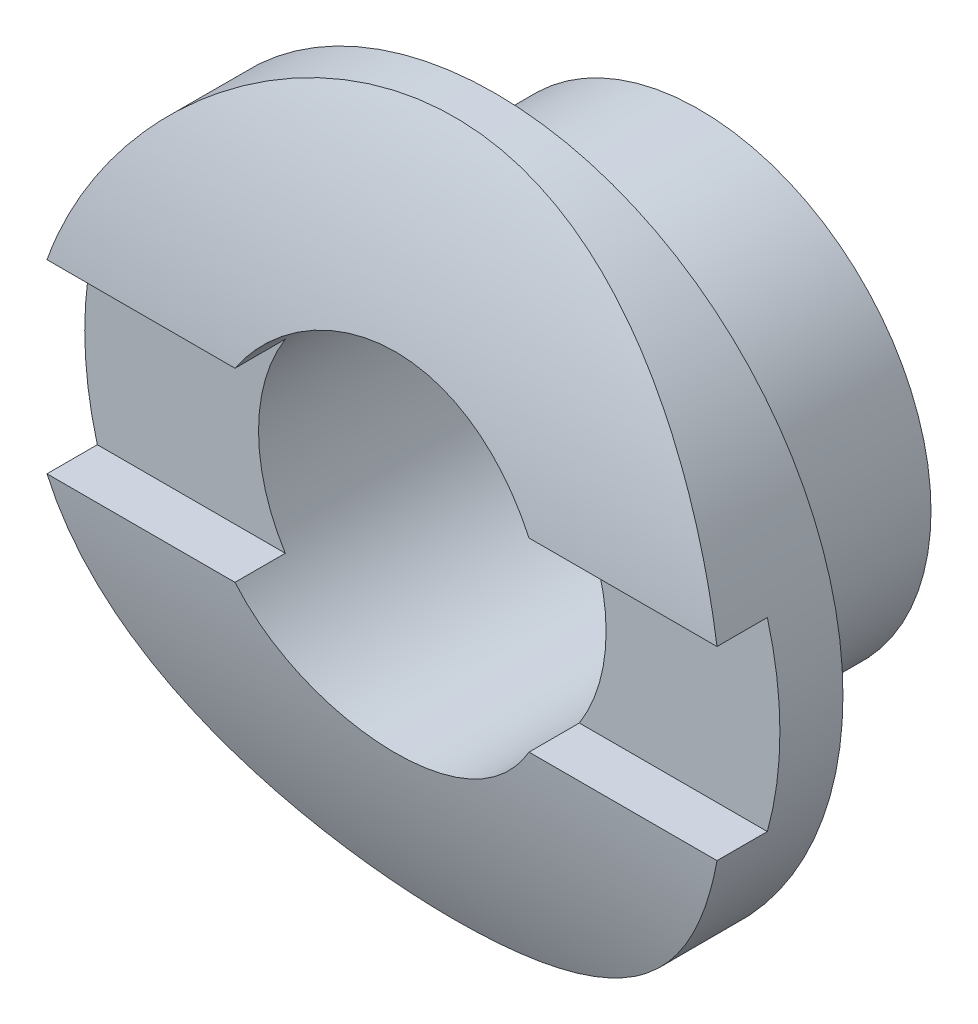
ISO-10303-21;
HEADER;
FILE_DESCRIPTION(('STEP AP214'),'2;1');
FILE_NAME('part.step','',(''),(''),'','','');
FILE_SCHEMA(('AUTOMOTIVE_DESIGN { 1 0 10303 214 1 1 1 1 }'));
ENDSEC;
DATA;
#1=APPLICATION_CONTEXT('core data for automotive mechanical design processes');
#2=APPLICATION_PROTOCOL_DEFINITION('international standard','automotive_design',2000,#1);
#3=PRODUCT_CONTEXT('',#1,'mechanical');
#4=PRODUCT('Part','Part','',(#3));
#5=PRODUCT_RELATED_PRODUCT_CATEGORY('part','',(#4));
#6=PRODUCT_DEFINITION_FORMATION('','',#4);
#7=PRODUCT_DEFINITION_CONTEXT('part definition',#1,'design');
#8=PRODUCT_DEFINITION('design','',#6,#7);
#9=PRODUCT_DEFINITION_SHAPE('','',#8);
#10=(LENGTH_UNIT() NAMED_UNIT(*) SI_UNIT(.MILLI.,.METRE.));
#11=(NAMED_UNIT(*) PLANE_ANGLE_UNIT() SI_UNIT($,.RADIAN.));
#12=(NAMED_UNIT(*) SI_UNIT($,.STERADIAN.) SOLID_ANGLE_UNIT());
#13=UNCERTAINTY_MEASURE_WITH_UNIT(LENGTH_MEASURE(1.E-05),#10,'distance_accuracy_value','');
#14=(GEOMETRIC_REPRESENTATION_CONTEXT(3) GLOBAL_UNCERTAINTY_ASSIGNED_CONTEXT((#13)) GLOBAL_UNIT_ASSIGNED_CONTEXT((#10,
#11,#12)) REPRESENTATION_CONTEXT('',''));
#15=CARTESIAN_POINT('',(0.,0.,0.));
#16=DIRECTION('',(0.,0.,1.));
#17=DIRECTION('',(1.,0.,0.));
#18=AXIS2_PLACEMENT_3D('',#15,#16,#17);
#19=CARTESIAN_POINT('',(-4.7625,0.,-6.7564));
#20=DIRECTION('',(1.,0.,0.));
#21=DIRECTION('',(0.,0.,-1.));
#22=AXIS2_PLACEMENT_3D('',#19,#20,#21);
#23=CYLINDRICAL_SURFACE('',#22,11.176);
#24=DIRECTION('',(1.,0.,0.));
#25=VECTOR('',#24,1.);
#26=CARTESIAN_POINT('',(-4.7625,1.27,4.34720644115236));
#27=LINE('',#26,#25);
#28=CARTESIAN_POINT('',(4.5900442535993,1.27,4.34720644115236));
#29=VERTEX_POINT('',#28);
#30=CARTESIAN_POINT('',(2.01431168454636,1.27,4.34720644115236));
#31=VERTEX_POINT('',#30);
#32=EDGE_CURVE('E208',#29,#31,#27,.F.);
#33=ORIENTED_EDGE('',*,*,#32,.F.);
#34=CARTESIAN_POINT('',(-4.7625,0.,4.41960000000001));
#35=CARTESIAN_POINT('',(-4.76249908627995,-0.12735444381493,4.41959925776926));
#36=CARTESIAN_POINT('',(-4.75738474062043,-0.25474842171347,4.41741723465418));
#37=CARTESIAN_POINT('',(-4.73697593452927,-0.508625919959165,4.4087434312503));
#38=CARTESIAN_POINT('',(-4.72167524133683,-0.6351088349256,4.40224901232513));
#39=CARTESIAN_POINT('',(-4.68101377088656,-0.886424731922299,4.38510434342349));
#40=CARTESIAN_POINT('',(-4.65563295632696,-1.01125391282532,4.37444581671034));
#41=CARTESIAN_POINT('',(-4.59506447609123,-1.25815614709239,4.34924855599192));
#42=CARTESIAN_POINT('',(-4.5598728019437,-1.38022805181781,4.33470823608635));
#43=CARTESIAN_POINT('',(-4.48017866213979,-1.62028770637933,4.30218272018447));
#44=CARTESIAN_POINT('',(-4.43571296311708,-1.73828950132155,4.2842111503986));
#45=CARTESIAN_POINT('',(-4.33778408831479,-1.96999507589533,4.24523305288586));
#46=CARTESIAN_POINT('',(-4.28431754624326,-2.08369722791548,4.2242253900856));
#47=CARTESIAN_POINT('',(-4.11111011606995,-2.41718739634414,4.15741677155239));
#48=CARTESIAN_POINT('',(-3.978455841027,-2.62967447714953,4.10778545222371));
#49=CARTESIAN_POINT('',(-3.67545614342657,-3.0398413194107,4.00043683776008));
#50=CARTESIAN_POINT('',(-3.50361839437496,-3.23633649746127,3.94244726509601));
#51=CARTESIAN_POINT('',(-3.13007708260298,-3.59884522799375,3.82601667255385));
#52=CARTESIAN_POINT('',(-2.92835722668354,-3.76484203994382,3.76757542298037));
#53=CARTESIAN_POINT('',(-2.6012709950442,-3.99170317278959,3.68277087068401));
#54=CARTESIAN_POINT('',(-2.48496431647269,-4.06513675985705,3.65431868745183));
#55=CARTESIAN_POINT('',(-2.24601182014853,-4.20187538576694,3.59988432677018));
#56=CARTESIAN_POINT('',(-2.12336866240447,-4.26518462975583,3.57390112565816));
#57=CARTESIAN_POINT('',(-1.87249680865822,-4.38112580523432,3.5252667542529));
#58=CARTESIAN_POINT('',(-1.74426794391121,-4.43375741387929,3.50261568471432));
#59=CARTESIAN_POINT('',(-1.48317221169835,-4.52778570400235,3.46146515562879));
#60=CARTESIAN_POINT('',(-1.35030780611148,-4.56918824959663,3.44296353000872));
#61=CARTESIAN_POINT('',(-1.08755046301325,-4.63855409165762,3.41159733354156));
#62=CARTESIAN_POINT('',(-0.957833581954807,-4.66707896726807,3.39849996545762));
#63=CARTESIAN_POINT('',(-0.696134849602933,-4.71322025152352,3.3771669695108));
#64=CARTESIAN_POINT('',(-0.564154089332185,-4.73084177096361,3.36892906392771));
#65=CARTESIAN_POINT('',(-0.298996781359505,-4.75496845145458,3.35762143018875));
#66=CARTESIAN_POINT('',(-0.165820587893187,-4.76147680296426,3.35455021873996));
#67=CARTESIAN_POINT('',(0.100621649801287,-4.76330004999866,3.35369154242626));
#68=CARTESIAN_POINT('',(0.233887688542796,-4.75861557632652,3.35590377979772));
#69=CARTESIAN_POINT('',(0.488580372698107,-4.73895153644503,3.3651323548155));
#70=CARTESIAN_POINT('',(0.61008982699337,-4.72483866990486,3.37174408268427));
#71=CARTESIAN_POINT('',(0.851409952819883,-4.6873684780483,3.3891398600058));
#72=CARTESIAN_POINT('',(0.971220057888757,-4.66400814185932,3.39992526833647));
#73=CARTESIAN_POINT('',(1.20828558434308,-4.6082828457106,3.425330780419));
#74=CARTESIAN_POINT('',(1.3255415609045,-4.57591986409522,3.43995004163576));
#75=CARTESIAN_POINT('',(1.55682701258214,-4.5024927957938,3.47258539193384));
#76=CARTESIAN_POINT('',(1.67085522190472,-4.46142534773528,3.49060279296559));
#77=CARTESIAN_POINT('',(2.01188019116621,-4.32372407283593,3.5498386973099));
#78=CARTESIAN_POINT('',(2.23285940515533,-4.21376111274915,3.59567895755876));
#79=CARTESIAN_POINT('',(2.65399846707199,-3.96207188696153,3.694589535023));
#80=CARTESIAN_POINT('',(2.85414985234123,-3.82033278335094,3.74766277103209));
#81=CARTESIAN_POINT('',(3.24679379086405,-3.4943496617202,3.86079518680427));
#82=CARTESIAN_POINT('',(3.43702867085161,-3.30744916848156,3.92105625279314));
#83=CARTESIAN_POINT('',(3.7842879810317,-2.90368686043525,4.03783890985767));
#84=CARTESIAN_POINT('',(3.94130390695026,-2.68681739680588,4.09435954081819));
#85=CARTESIAN_POINT('',(4.15019671273543,-2.34012085443301,4.17252605283561));
#86=CARTESIAN_POINT('',(4.21604578105556,-2.21931601956612,4.19775470369621));
#87=CARTESIAN_POINT('',(4.33724729538594,-1.97196094223773,4.24497082997028));
#88=CARTESIAN_POINT('',(4.39260402270449,-1.84541306941143,4.26695962655908));
#89=CARTESIAN_POINT('',(4.49226298925976,-1.58748121713849,4.30704957816776));
#90=CARTESIAN_POINT('',(4.53656798520304,-1.45609845309236,4.32515170250882));
#91=CARTESIAN_POINT('',(4.61365506739347,-1.18947201257857,4.35693196271366));
#92=CARTESIAN_POINT('',(4.64643807481995,-1.05422864570007,4.37061045223864));
#93=CARTESIAN_POINT('',(4.69832848861546,-0.789963788052934,4.39238220052065));
#94=CARTESIAN_POINT('',(4.71819145272836,-0.661115547956151,4.40078279099879));
#95=CARTESIAN_POINT('',(4.74729206355814,-0.402015113450935,4.41311999282715));
#96=CARTESIAN_POINT('',(4.756530326094,-0.271763000854194,4.41705686289915));
#97=CARTESIAN_POINT('',(4.76427414782392,-0.0109155631938609,4.42035559316027));
#98=CARTESIAN_POINT('',(4.76278244338882,0.11967966587586,4.41971861977726));
#99=CARTESIAN_POINT('',(4.74909140694899,0.380201175120254,4.41389100559022));
#100=CARTESIAN_POINT('',(4.73689233353275,0.510127471373777,4.40870047475696));
#101=CARTESIAN_POINT('',(4.70284598273652,0.761490842497033,4.3942997097558));
#102=CARTESIAN_POINT('',(4.68154097543584,0.883014489949856,4.38531570006133));
#103=CARTESIAN_POINT('',(4.62966534598144,1.12373956949306,4.36361923160614));
#104=CARTESIAN_POINT('',(4.59909171509113,1.2429402341152,4.35090556218438));
#105=CARTESIAN_POINT('',(4.4938743520626,1.59581161798998,4.30760925440499));
#106=CARTESIAN_POINT('',(4.40570359191107,1.82497381919436,4.27185778904461));
#107=CARTESIAN_POINT('',(4.19302209743858,2.27229436765659,4.18860678308459));
#108=CARTESIAN_POINT('',(4.06746318554019,2.48988615545105,4.14077544292814));
#109=CARTESIAN_POINT('',(3.78467479986146,2.90173271633515,4.03841270854708));
#110=CARTESIAN_POINT('',(3.62743186133187,3.09597751144233,3.9838784696498));
#111=CARTESIAN_POINT('',(3.27209552767861,3.47079479715498,3.86893896733243));
#112=CARTESIAN_POINT('',(3.07183014584953,3.6492672506089,3.80839916839721));
#113=CARTESIAN_POINT('',(2.64313619331202,3.97075799111835,3.69182344619456));
#114=CARTESIAN_POINT('',(2.4147001218667,4.11376680496345,3.63578872904083));
#115=CARTESIAN_POINT('',(2.05307932199713,4.29943407140319,3.559724222433));
#116=CARTESIAN_POINT('',(1.92817140756517,4.35689603082942,3.53552103351426));
#117=CARTESIAN_POINT('',(1.67329741644856,4.46098621692028,3.49083320092745));
#118=CARTESIAN_POINT('',(1.54333361179793,4.50761924574304,3.47034690986219));
#119=CARTESIAN_POINT('',(1.27933800840301,4.58953140281474,3.43384978588491));
#120=CARTESIAN_POINT('',(1.14530827998563,4.62481620669551,3.41783671629159));
#121=CARTESIAN_POINT('',(0.874192522749246,4.68363379904573,3.3908952755164));
#122=CARTESIAN_POINT('',(0.73710680183741,4.70716776593264,3.37996639448079));
#123=CARTESIAN_POINT('',(0.472121201921622,4.74076934422994,3.36429141877333));
#124=CARTESIAN_POINT('',(0.344363117401417,4.75176312369259,3.35912088508703));
#125=CARTESIAN_POINT('',(0.0882247786741189,4.76340858849557,3.35364242710178));
#126=CARTESIAN_POINT('',(-0.0401556690974063,4.7640568181199,3.35333612759936));
#127=CARTESIAN_POINT('',(-0.296397296226178,4.75499550369817,3.35760108626436));
#128=CARTESIAN_POINT('',(-0.42425871914086,4.74529156867568,3.36216970309846));
#129=CARTESIAN_POINT('',(-0.678576890301018,4.71564805813418,3.37601855390653));
#130=CARTESIAN_POINT('',(-0.805033090832775,4.69570462530406,3.38530056344356));
#131=CARTESIAN_POINT('',(-1.04910488728332,4.64709156941073,3.40766377767885));
#132=CARTESIAN_POINT('',(-1.16684078064725,4.61892320737778,3.42052516115437));
#133=CARTESIAN_POINT('',(-1.39943580997867,4.55385442390978,3.44980645604327));
#134=CARTESIAN_POINT('',(-1.51429394221124,4.51695100139644,3.46622759030589));
#135=CARTESIAN_POINT('',(-1.85348860185406,4.39360653848005,3.52014161391342));
#136=CARTESIAN_POINT('',(-2.07261566173582,4.29449696249918,3.56230178195823));
#137=CARTESIAN_POINT('',(-2.50503855727718,4.05840271462377,3.65750582273753));
#138=CARTESIAN_POINT('',(-2.71714347505829,3.91946083918446,3.71106019115908));
#139=CARTESIAN_POINT('',(-3.11619945155893,3.61032902117768,3.82166590531342));
#140=CARTESIAN_POINT('',(-3.30314111397788,3.44012746160521,3.87871854583733));
#141=CARTESIAN_POINT('',(-3.66156832375093,3.05747296893765,3.99523642043131));
#142=CARTESIAN_POINT('',(-3.83072694194117,2.8427655956086,4.0545450512136));
#143=CARTESIAN_POINT('',(-4.0556281793658,2.5004054377026,4.13693949587218));
#144=CARTESIAN_POINT('',(-4.12583487124168,2.38279736704716,4.16332850591355));
#145=CARTESIAN_POINT('',(-4.25606826176605,2.14150643544623,4.21319718351463));
#146=CARTESIAN_POINT('',(-4.31609966614696,2.01782641689212,4.23667819456653));
#147=CARTESIAN_POINT('',(-4.42463338511045,1.76704008849995,4.27974541260598));
#148=CARTESIAN_POINT('',(-4.4732901452037,1.64000938862141,4.29938312299597));
#149=CARTESIAN_POINT('',(-4.55966773764825,1.38179419483384,4.33461364572514));
#150=CARTESIAN_POINT('',(-4.59739378441839,1.2506117147415,4.35020838635937));
#151=CARTESIAN_POINT('',(-4.66143603525206,0.985388165214541,4.37687040435202));
#152=CARTESIAN_POINT('',(-4.68778012360295,0.851354935629632,4.38794874249384));
#153=CARTESIAN_POINT('',(-4.72886354945078,0.581281431530982,4.40529207766297));
#154=CARTESIAN_POINT('',(-4.74361125137623,0.445242675883857,4.41156054395316));
#155=CARTESIAN_POINT('',(-4.75581736234175,0.257417181408033,4.41675368644699));
#156=CARTESIAN_POINT('',(-4.7583225827945,0.205973840025434,4.41782039536514));
#157=CARTESIAN_POINT('',(-4.76166409097545,0.103022488822023,4.41924370419406));
#158=CARTESIAN_POINT('',(-4.76250036959694,0.0515144786498762,4.41960030023005));
#159=CARTESIAN_POINT('',(-4.7625,0.,4.41960000000001));
#160=B_SPLINE_CURVE_WITH_KNOTS('',3,(#34,#35,#36,#37,#38,#39,#40,#41,#42,#43,#44,#45,#46,#47,
#48,#49,#50,#51,#52,#53,#54,#55,#56,#57,#58,#59,#60,#61,#62,#63,#64,#65,#66,#67,#68,#69,#70,#71,
#72,#73,#74,#75,#76,#77,#78,#79,#80,#81,#82,#83,#84,#85,#86,#87,#88,#89,#90,#91,#92,#93,#94,#95,
#96,#97,#98,#99,#100,#101,#102,#103,#104,#105,#106,#107,#108,#109,#110,#111,#112,#113,#114,#115,
#116,#117,#118,#119,#120,#121,#122,#123,#124,#125,#126,#127,#128,#129,#130,#131,#132,#133,#134,
#135,#136,#137,#138,#139,#140,#141,#142,#143,#144,#145,#146,#147,#148,#149,#150,#151,#152,#153,
#154,#155,#156,#157,#158,#159),.UNSPECIFIED.,.T.,.F.,(4,2,2,2,2,2,2,2,2,2,2,2,2,2,2,2,2,2,2,2,2,
2,2,2,2,2,2,2,2,2,2,2,2,2,2,2,2,2,2,2,2,2,2,2,2,2,2,2,2,2,2,2,2,2,2,2,2,2,2,2,2,2,4),(0.,
0.38201115030685,0.764256258381069,1.14726502850129,1.53043051633111,1.91210488552968,
2.29392231837324,3.0565622679194,3.85546708762347,4.65480912400562,5.07575317001723,
5.49652192022872,5.91730339073732,6.33786469296505,6.73770793323449,7.13736361033699,
7.53690453172872,7.93642293639919,8.30350581798584,8.67070831607999,9.03783018455179,
9.40509408229305,10.1548201434256,10.9048496497011,11.7214694020958,12.5382979622959,
12.9574812125084,13.3764930486806,13.7954002632073,14.2142739786124,14.6056912275771,
14.9970857884388,15.388380538864,15.7796658395786,16.1503329326895,16.521120479068,
17.2620299500166,18.0260605855581,18.7904165983199,19.6117770792513,20.4333567299989,
20.8517087042049,21.2698748017648,21.6878314338868,22.1057461433475,22.4902502037987,
22.8748826971561,23.2593068942222,23.6438760137178,24.0086766710141,24.3736028441549,
25.1029377154581,25.8772045843457,26.6517597776241,27.4864520930924,27.9044846926086,
28.322323435313,28.7341079849132,29.1456957709776,29.556269423772,29.9665466590315,
30.1210681447155,30.2755904735562),.UNSPECIFIED.);
#161=CARTESIAN_POINT('',(-4.59004425359931,1.27,4.34720644115236));
#162=VERTEX_POINT('',#161);
#163=EDGE_CURVE('E178',#29,#162,#160,.T.);
#164=ORIENTED_EDGE('',*,*,#163,.T.);
#165=CARTESIAN_POINT('',(-2.01431168454636,1.27,4.34720644115236));
#166=VERTEX_POINT('',#165);
#167=EDGE_CURVE('E213',#166,#162,#27,.F.);
#168=ORIENTED_EDGE('',*,*,#167,.F.);
#169=CARTESIAN_POINT('',(-2.38125,0.,4.4196));
#170=CARTESIAN_POINT('',(-2.3812453723746,-0.132155003614596,4.41959755457693));
#171=CARTESIAN_POINT('',(-2.37021130671353,-0.264366709747853,4.4172320272524));
#172=CARTESIAN_POINT('',(-2.32640904320225,-0.525040390528454,4.40802385251336));
#173=CARTESIAN_POINT('',(-2.29362477474237,-0.653499519175429,4.4011778946861));
#174=CARTESIAN_POINT('',(-2.20739103142042,-0.902862580587149,4.38377179034517));
#175=CARTESIAN_POINT('',(-2.15396258907947,-1.02377405782377,4.37321542502283));
#176=CARTESIAN_POINT('',(-2.02802258795482,-1.25491113954769,4.34953039176637));
#177=CARTESIAN_POINT('',(-1.9555117209275,-1.36513713119603,4.33640181708173));
#178=CARTESIAN_POINT('',(-1.79229273592851,-1.57346308128293,4.30878850816872));
#179=CARTESIAN_POINT('',(-1.70134917401566,-1.67137645720433,4.29428767395423));
#180=CARTESIAN_POINT('',(-1.50435202354789,-1.8506806238609,4.26567875731085));
#181=CARTESIAN_POINT('',(-1.39829714298653,-1.93207000036216,4.25157070858823));
#182=CARTESIAN_POINT('',(-1.17271993480626,-2.07683001023698,4.22518648772817));
#183=CARTESIAN_POINT('',(-1.05306859101236,-2.14000370023633,4.21293097340781));
#184=CARTESIAN_POINT('',(-0.80454432635009,-2.2452762794749,4.19186979682291));
#185=CARTESIAN_POINT('',(-0.675672449712345,-2.28737755087331,4.18306374463387));
#186=CARTESIAN_POINT('',(-0.414384260956349,-2.34869693424378,4.17006219720279));
#187=CARTESIAN_POINT('',(-0.282048629760719,-2.36824448094583,4.16580039744375));
#188=CARTESIAN_POINT('',(-0.0159128520017445,-2.3849255356171,4.1621706251422));
#189=CARTESIAN_POINT('',(0.117887122229516,-2.38206165335694,4.16280208278859));
#190=CARTESIAN_POINT('',(0.3807165993286,-2.35426664044835,4.16882738338017));
#191=CARTESIAN_POINT('',(0.50978857615791,-2.32971662405395,4.17413897317483));
#192=CARTESIAN_POINT('',(0.76193881434847,-2.25984933522199,4.18879617645507));
#193=CARTESIAN_POINT('',(0.885016754509139,-2.214530951228,4.19814200585809));
#194=CARTESIAN_POINT('',(1.1227649458423,-2.10405908555721,4.21989664716894));
#195=CARTESIAN_POINT('',(1.23736428938765,-2.03875766063977,4.23232816956602));
#196=CARTESIAN_POINT('',(1.45412021544137,-1.89027751500839,4.25883934978073));
#197=CARTESIAN_POINT('',(1.55627518144605,-1.807096475634,4.27291922125127));
#198=CARTESIAN_POINT('',(1.74743830282305,-1.62319368591866,4.30149464022565));
#199=CARTESIAN_POINT('',(1.83613422976716,-1.52214748051414,4.31599279399476));
#200=CARTESIAN_POINT('',(1.99537034882005,-1.30645268816842,4.34350805841452));
#201=CARTESIAN_POINT('',(2.06591024381047,-1.19180387866928,4.35652514482597));
#202=CARTESIAN_POINT('',(2.18690300418608,-0.951787916102792,4.37965052150224));
#203=CARTESIAN_POINT('',(2.23731658377185,-0.826400374967643,4.3897531122294));
#204=CARTESIAN_POINT('',(2.31627337177244,-0.568671224766092,4.40586859886758));
#205=CARTESIAN_POINT('',(2.3448195946149,-0.436330576878099,4.41188205845483));
#206=CARTESIAN_POINT('',(2.37878098124961,-0.171131591746981,4.41906203484544));
#207=CARTESIAN_POINT('',(2.38462289125187,-0.0383302537227902,4.42031796181916));
#208=CARTESIAN_POINT('',(2.37416419600676,0.226350753686958,4.41809122900304));
#209=CARTESIAN_POINT('',(2.35786501205365,0.358230481686839,4.41460887337582));
#210=CARTESIAN_POINT('',(2.30394090010609,0.615922319135743,4.40335313397734));
#211=CARTESIAN_POINT('',(2.26653829082144,0.741783078225829,4.39562450542661));
#212=CARTESIAN_POINT('',(2.17171462370835,0.985445139845618,4.37674066532962));
#213=CARTESIAN_POINT('',(2.11429192165795,1.10324577945821,4.36558517234877));
#214=CARTESIAN_POINT('',(1.9801583872331,1.32921924796167,4.34086370490671));
#215=CARTESIAN_POINT('',(1.90319491611518,1.4372386685293,4.32726689936756));
#216=CARTESIAN_POINT('',(1.73249895657737,1.63898244105711,4.29923678647442));
#217=CARTESIAN_POINT('',(1.63876440913478,1.73270503514341,4.2848033765559));
#218=CARTESIAN_POINT('',(1.43523347211915,1.90486949560112,4.25642025697156));
#219=CARTESIAN_POINT('',(1.32518565221608,1.98301661880368,4.24248335924207));
#220=CARTESIAN_POINT('',(1.09327613266115,2.11972013187018,4.21695947501687));
#221=CARTESIAN_POINT('',(0.9714149346471,2.17827735312106,4.2053723888044));
#222=CARTESIAN_POINT('',(0.719981828509718,2.27375407489681,4.18596694732177));
#223=CARTESIAN_POINT('',(0.59045683815275,2.31079271658833,4.17812788412608));
#224=CARTESIAN_POINT('',(0.326834193444327,2.36253408721547,4.16706654908767));
#225=CARTESIAN_POINT('',(0.192737230733609,2.37724017938931,4.16384358207406));
#226=CARTESIAN_POINT('',(-0.0732550819966534,2.38376159046743,4.16242156029031));
#227=CARTESIAN_POINT('',(-0.205138656056966,2.37604371523563,4.16412005214717));
#228=CARTESIAN_POINT('',(-0.465680304798495,2.33897570909105,4.17211873392995));
#229=CARTESIAN_POINT('',(-0.594338413529194,2.30962580663533,4.1784188752576));
#230=CARTESIAN_POINT('',(-0.844429126055678,2.23034714078661,4.19486231228564));
#231=CARTESIAN_POINT('',(-0.965883060863616,2.1804829979679,4.20499353192626));
#232=CARTESIAN_POINT('',(-1.19877164831041,2.06164809865232,4.22796295481429));
#233=CARTESIAN_POINT('',(-1.31020531776925,1.99267546995055,4.24080142328218));
#234=CARTESIAN_POINT('',(-1.52219866660454,1.83601885030138,4.26804713942361));
#235=CARTESIAN_POINT('',(-1.6225082533397,1.74800078019269,4.28247979143047));
#236=CARTESIAN_POINT('',(-1.80708711829646,1.55643288348131,4.31111345020399));
#237=CARTESIAN_POINT('',(-1.89135269256532,1.45287948020234,4.32531440278988));
#238=CARTESIAN_POINT('',(-2.04242968741017,1.23166239954829,4.35208930048453));
#239=CARTESIAN_POINT('',(-2.10901615068068,1.11384230180273,4.36464133557956));
#240=CARTESIAN_POINT('',(-2.22133619587208,0.868442957270206,4.38648574966616));
#241=CARTESIAN_POINT('',(-2.26708767636242,0.740872197378992,4.39578092491734));
#242=CARTESIAN_POINT('',(-2.32806366747813,0.510935504312515,4.40835965253543));
#243=CARTESIAN_POINT('',(-2.34797127676331,0.409834749868542,4.41254912784698));
#244=CARTESIAN_POINT('',(-2.37456597980223,0.205834081914598,4.41817019856745));
#245=CARTESIAN_POINT('',(-2.3812536044122,0.102934240815409,4.41960190471614));
#246=CARTESIAN_POINT('',(-2.38125,0.,4.4196));
#247=B_SPLINE_CURVE_WITH_KNOTS('',3,(#169,#170,#171,#172,#173,#174,#175,#176,#177,#178,#179,
#180,#181,#182,#183,#184,#185,#186,#187,#188,#189,#190,#191,#192,#193,#194,#195,#196,#197,#198,
#199,#200,#201,#202,#203,#204,#205,#206,#207,#208,#209,#210,#211,#212,#213,#214,#215,#216,#217,
#218,#219,#220,#221,#222,#223,#224,#225,#226,#227,#228,#229,#230,#231,#232,#233,#234,#235,#236,
#237,#238,#239,#240,#241,#242,#243,#244,#245,#246),.UNSPECIFIED.,.T.,.F.,(4,2,2,2,2,2,2,2,2,2,2,
2,2,2,2,2,2,2,2,2,2,2,2,2,2,2,2,2,2,2,2,2,2,2,2,2,2,2,4),(0.,0.396088298564253,
0.792469581991492,1.18844808793355,1.58441224124802,1.98579502578947,2.38721214887402,
2.7928191867482,3.19838036188063,3.59793949716615,3.9974521052012,4.3900802935295,
4.78272949840434,5.17835902466495,5.57403988785853,5.97782737367008,6.38162146693024,
6.78619994163504,7.19072263492437,7.58760413826442,7.98446016595498,8.37721145879265,
8.76999501534082,9.16814128446557,9.56633646848516,9.97147062092217,10.3765875774597,
10.7794396191817,11.1822309861566,11.5766977990431,11.9711604460033,12.3643899219575,
12.7576579392528,13.1584827520748,13.5593999882092,13.9651976157,14.3706459766554,
14.6791676707096,14.9876769756428),.UNSPECIFIED.);
#248=EDGE_CURVE('E152',#31,#166,#247,.T.);
#249=ORIENTED_EDGE('',*,*,#248,.F.);
#250=EDGE_LOOP('',(#33,#164,#168,#249));
#251=FACE_BOUND('',#250,.T.);
#252=ADVANCED_FACE('F38',(#251),#23,.T.);
#253=CARTESIAN_POINT('',(0.,0.,2.794));
#254=DIRECTION('',(0.,0.,-1.));
#255=DIRECTION('',(-1.,0.,0.));
#256=AXIS2_PLACEMENT_3D('',#253,#254,#255);
#257=CYLINDRICAL_SURFACE('',#256,2.38125);
#258=DIRECTION('',(0.,0.,-1.));
#259=VECTOR('',#258,1.);
#260=CARTESIAN_POINT('',(-2.01431168454636,1.27,2.794));
#261=LINE('',#260,#259);
#262=CARTESIAN_POINT('',(-2.01431168454636,1.27,3.6576));
#263=VERTEX_POINT('',#262);
#264=EDGE_CURVE('E138',#263,#166,#261,.F.);
#265=ORIENTED_EDGE('',*,*,#264,.F.);
#266=CARTESIAN_POINT('',(0.,0.,3.6576));
#267=DIRECTION('',(0.,0.,-1.));
#268=DIRECTION('',(-1.,0.,0.));
#269=AXIS2_PLACEMENT_3D('',#266,#267,#268);
#270=CIRCLE('',#269,2.38125);
#271=CARTESIAN_POINT('',(-2.01431168454636,-1.27,3.6576));
#272=VERTEX_POINT('',#271);
#273=EDGE_CURVE('E148',#272,#263,#270,.T.);
#274=ORIENTED_EDGE('',*,*,#273,.F.);
#275=DIRECTION('',(0.,0.,-1.));
#276=VECTOR('',#275,1.);
#277=CARTESIAN_POINT('',(-2.01431168454636,-1.27,2.794));
#278=LINE('',#277,#276);
#279=CARTESIAN_POINT('',(-2.01431168454636,-1.27,4.34720644115236));
#280=VERTEX_POINT('',#279);
#281=EDGE_CURVE('E115',#280,#272,#278,.T.);
#282=ORIENTED_EDGE('',*,*,#281,.F.);
#283=CARTESIAN_POINT('',(2.01431168454918,-1.27000000000121,4.34720644115268));
#284=VERTEX_POINT('',#283);
#285=EDGE_CURVE('E161',#280,#284,#247,.T.);
#286=ORIENTED_EDGE('',*,*,#285,.T.);
#287=DIRECTION('',(0.,0.,-1.));
#288=VECTOR('',#287,1.);
#289=CARTESIAN_POINT('',(2.01431168454636,-1.27,2.794));
#290=LINE('',#289,#288);
#291=CARTESIAN_POINT('',(2.01431168454636,-1.27,3.6576));
#292=VERTEX_POINT('',#291);
#293=EDGE_CURVE('E62',#292,#284,#290,.F.);
#294=ORIENTED_EDGE('',*,*,#293,.F.);
#295=CARTESIAN_POINT('',(2.01431168454636,1.27,3.6576));
#296=VERTEX_POINT('',#295);
#297=EDGE_CURVE('E151',#296,#292,#270,.T.);
#298=ORIENTED_EDGE('',*,*,#297,.F.);
#299=DIRECTION('',(0.,0.,-1.));
#300=VECTOR('',#299,1.);
#301=CARTESIAN_POINT('',(2.01431168454636,1.27,2.794));
#302=LINE('',#301,#300);
#303=EDGE_CURVE('E145',#31,#296,#302,.T.);
#304=ORIENTED_EDGE('',*,*,#303,.F.);
#305=ORIENTED_EDGE('',*,*,#248,.T.);
#306=EDGE_LOOP('',(#265,#274,#282,#286,#294,#298,#304,#305));
#307=FACE_BOUND('',#306,.T.);
#308=CARTESIAN_POINT('',(0.,0.,0.));
#309=DIRECTION('',(0.,0.,1.));
#310=DIRECTION('',(1.,0.,0.));
#311=AXIS2_PLACEMENT_3D('',#308,#309,#310);
#312=CIRCLE('',#311,2.38125);
#313=CARTESIAN_POINT('',(2.38125,0.,0.));
#314=VERTEX_POINT('',#313);
#315=EDGE_CURVE('E227',#314,#314,#312,.T.);
#316=ORIENTED_EDGE('',*,*,#315,.F.);
#317=EDGE_LOOP('',(#316));
#318=FACE_BOUND('',#317,.T.);
#319=ADVANCED_FACE('F164',(#307,#318),#257,.F.);
#320=CARTESIAN_POINT('',(0.,0.,4.4196));
#321=DIRECTION('',(0.,0.,-1.));
#322=DIRECTION('',(-1.,0.,0.));
#323=AXIS2_PLACEMENT_3D('',#320,#321,#322);
#324=CYLINDRICAL_SURFACE('',#323,4.7625);
#325=CARTESIAN_POINT('',(0.,0.,2.794));
#326=DIRECTION('',(0.,0.,1.));
#327=DIRECTION('',(1.,0.,0.));
#328=AXIS2_PLACEMENT_3D('',#325,#326,#327);
#329=CIRCLE('',#328,4.7625);
#330=CARTESIAN_POINT('',(4.7625,0.,2.794));
#331=VERTEX_POINT('',#330);
#332=EDGE_CURVE('E162',#331,#331,#329,.T.);
#333=ORIENTED_EDGE('',*,*,#332,.T.);
#334=EDGE_LOOP('',(#333));
#335=FACE_BOUND('',#334,.T.);
#336=ORIENTED_EDGE('',*,*,#163,.F.);
#337=DIRECTION('',(0.,0.,-1.));
#338=VECTOR('',#337,1.);
#339=CARTESIAN_POINT('',(4.5900442535993,1.27,4.4196));
#340=LINE('',#339,#338);
#341=CARTESIAN_POINT('',(4.5900442535993,1.27,3.6576));
#342=VERTEX_POINT('',#341);
#343=EDGE_CURVE('E141',#29,#342,#340,.T.);
#344=ORIENTED_EDGE('',*,*,#343,.T.);
#345=CARTESIAN_POINT('',(0.,0.,3.6576));
#346=DIRECTION('',(0.,0.,-1.));
#347=DIRECTION('',(-1.,0.,0.));
#348=AXIS2_PLACEMENT_3D('',#345,#346,#347);
#349=CIRCLE('',#348,4.7625);
#350=CARTESIAN_POINT('',(4.5900442535993,-1.27,3.6576));
#351=VERTEX_POINT('',#350);
#352=EDGE_CURVE('E42',#342,#351,#349,.T.);
#353=ORIENTED_EDGE('',*,*,#352,.T.);
#354=DIRECTION('',(0.,0.,-1.));
#355=VECTOR('',#354,1.);
#356=CARTESIAN_POINT('',(4.5900442535993,-1.27,4.4196));
#357=LINE('',#356,#355);
#358=CARTESIAN_POINT('',(4.5900442535993,-1.27,4.34720644115236));
#359=VERTEX_POINT('',#358);
#360=EDGE_CURVE('E132',#351,#359,#357,.F.);
#361=ORIENTED_EDGE('',*,*,#360,.T.);
#362=CARTESIAN_POINT('',(-4.59004425359942,-1.27000000000006,4.3472064411524));
#363=VERTEX_POINT('',#362);
#364=EDGE_CURVE('E125',#363,#359,#160,.T.);
#365=ORIENTED_EDGE('',*,*,#364,.F.);
#366=DIRECTION('',(0.,0.,-1.));
#367=VECTOR('',#366,1.);
#368=CARTESIAN_POINT('',(-4.5900442535993,-1.27,4.4196));
#369=LINE('',#368,#367);
#370=CARTESIAN_POINT('',(-4.5900442535993,-1.27,3.6576));
#371=VERTEX_POINT('',#370);
#372=EDGE_CURVE('E54',#363,#371,#369,.T.);
#373=ORIENTED_EDGE('',*,*,#372,.T.);
#374=CARTESIAN_POINT('',(-4.5900442535993,1.27,3.6576));
#375=VERTEX_POINT('',#374);
#376=EDGE_CURVE('E11',#371,#375,#349,.T.);
#377=ORIENTED_EDGE('',*,*,#376,.T.);
#378=DIRECTION('',(0.,0.,-1.));
#379=VECTOR('',#378,1.);
#380=CARTESIAN_POINT('',(-4.5900442535993,1.27,4.4196));
#381=LINE('',#380,#379);
#382=EDGE_CURVE('E130',#375,#162,#381,.F.);
#383=ORIENTED_EDGE('',*,*,#382,.T.);
#384=EDGE_LOOP('',(#336,#344,#353,#361,#365,#373,#377,#383));
#385=FACE_BOUND('',#384,.T.);
#386=ADVANCED_FACE('F122',(#335,#385),#324,.T.);
#387=CARTESIAN_POINT('',(0.,0.,0.));
#388=DIRECTION('',(0.,0.,1.));
#389=DIRECTION('',(1.,0.,0.));
#390=AXIS2_PLACEMENT_3D('',#387,#388,#389);
#391=PLANE('',#390);
#392=CARTESIAN_POINT('',(0.,0.,0.));
#393=DIRECTION('',(0.,0.,1.));
#394=DIRECTION('',(1.,0.,0.));
#395=AXIS2_PLACEMENT_3D('',#392,#393,#394);
#396=CIRCLE('',#395,3.175);
#397=CARTESIAN_POINT('',(3.175,0.,0.));
#398=VERTEX_POINT('',#397);
#399=EDGE_CURVE('E187',#398,#398,#396,.T.);
#400=ORIENTED_EDGE('',*,*,#399,.F.);
#401=EDGE_LOOP('',(#400));
#402=FACE_BOUND('',#401,.T.);
#403=ORIENTED_EDGE('',*,*,#315,.T.);
#404=EDGE_LOOP('',(#403));
#405=FACE_BOUND('',#404,.T.);
#406=ADVANCED_FACE('F192',(#402,#405),#391,.F.);
#407=CARTESIAN_POINT('',(0.,0.,2.794));
#408=DIRECTION('',(0.,0.,-1.));
#409=DIRECTION('',(-1.,0.,0.));
#410=AXIS2_PLACEMENT_3D('',#407,#408,#409);
#411=CYLINDRICAL_SURFACE('',#410,3.175);
#412=CARTESIAN_POINT('',(0.,0.,2.794));
#413=DIRECTION('',(0.,0.,1.));
#414=DIRECTION('',(1.,0.,0.));
#415=AXIS2_PLACEMENT_3D('',#412,#413,#414);
#416=CIRCLE('',#415,3.175);
#417=CARTESIAN_POINT('',(3.175,0.,2.794));
#418=VERTEX_POINT('',#417);
#419=EDGE_CURVE('E186',#418,#418,#416,.T.);
#420=ORIENTED_EDGE('',*,*,#419,.F.);
#421=EDGE_LOOP('',(#420));
#422=FACE_BOUND('',#421,.T.);
#423=ORIENTED_EDGE('',*,*,#399,.T.);
#424=EDGE_LOOP('',(#423));
#425=FACE_BOUND('',#424,.T.);
#426=ADVANCED_FACE('F40',(#422,#425),#411,.T.);
#427=CARTESIAN_POINT('',(0.,0.,2.794));
#428=DIRECTION('',(0.,0.,1.));
#429=DIRECTION('',(1.,0.,0.));
#430=AXIS2_PLACEMENT_3D('',#427,#428,#429);
#431=PLANE('',#430);
#432=ORIENTED_EDGE('',*,*,#419,.T.);
#433=EDGE_LOOP('',(#432));
#434=FACE_BOUND('',#433,.T.);
#435=ORIENTED_EDGE('',*,*,#332,.F.);
#436=EDGE_LOOP('',(#435));
#437=FACE_BOUND('',#436,.T.);
#438=ADVANCED_FACE('F173',(#434,#437),#431,.F.);
#439=DIRECTION('',(1.,0.,0.));
#440=VECTOR('',#439,1.);
#441=CARTESIAN_POINT('',(-4.7625,-1.27,4.34720644115236));
#442=LINE('',#441,#440);
#443=EDGE_CURVE('E219',#363,#280,#442,.T.);
#444=ORIENTED_EDGE('',*,*,#443,.F.);
#445=ORIENTED_EDGE('',*,*,#364,.T.);
#446=EDGE_CURVE('E189',#284,#359,#442,.T.);
#447=ORIENTED_EDGE('',*,*,#446,.F.);
#448=ORIENTED_EDGE('',*,*,#285,.F.);
#449=EDGE_LOOP('',(#444,#445,#447,#448));
#450=FACE_BOUND('',#449,.T.);
#451=ADVANCED_FACE('F167',(#450),#23,.T.);
#452=CARTESIAN_POINT('',(-4.7625,-1.27,4.4196));
#453=DIRECTION('',(0.,-1.,0.));
#454=DIRECTION('',(0.,0.,-1.));
#455=AXIS2_PLACEMENT_3D('',#452,#453,#454);
#456=PLANE('',#455);
#457=ORIENTED_EDGE('',*,*,#293,.T.);
#458=ORIENTED_EDGE('',*,*,#446,.T.);
#459=ORIENTED_EDGE('',*,*,#360,.F.);
#460=DIRECTION('',(1.,0.,0.));
#461=VECTOR('',#460,1.);
#462=CARTESIAN_POINT('',(-4.7625,-1.27,3.6576));
#463=LINE('',#462,#461);
#464=EDGE_CURVE('E118',#292,#351,#463,.T.);
#465=ORIENTED_EDGE('',*,*,#464,.F.);
#466=EDGE_LOOP('',(#457,#458,#459,#465));
#467=FACE_BOUND('',#466,.T.);
#468=ADVANCED_FACE('F172',(#467),#456,.F.);
#469=CARTESIAN_POINT('',(-4.7625,1.27,4.4196));
#470=DIRECTION('',(0.,1.,0.));
#471=DIRECTION('',(0.,0.,1.));
#472=AXIS2_PLACEMENT_3D('',#469,#470,#471);
#473=PLANE('',#472);
#474=ORIENTED_EDGE('',*,*,#303,.T.);
#475=DIRECTION('',(1.,0.,0.));
#476=VECTOR('',#475,1.);
#477=CARTESIAN_POINT('',(-4.7625,1.27,3.6576));
#478=LINE('',#477,#476);
#479=EDGE_CURVE('E117',#296,#342,#478,.T.);
#480=ORIENTED_EDGE('',*,*,#479,.T.);
#481=ORIENTED_EDGE('',*,*,#343,.F.);
#482=ORIENTED_EDGE('',*,*,#32,.T.);
#483=EDGE_LOOP('',(#474,#480,#481,#482));
#484=FACE_BOUND('',#483,.T.);
#485=ADVANCED_FACE('F266',(#484),#473,.F.);
#486=CARTESIAN_POINT('',(-4.7625,1.27,3.6576));
#487=DIRECTION('',(0.,0.,-1.));
#488=DIRECTION('',(-1.,0.,0.));
#489=AXIS2_PLACEMENT_3D('',#486,#487,#488);
#490=PLANE('',#489);
#491=ORIENTED_EDGE('',*,*,#297,.T.);
#492=ORIENTED_EDGE('',*,*,#464,.T.);
#493=ORIENTED_EDGE('',*,*,#352,.F.);
#494=ORIENTED_EDGE('',*,*,#479,.F.);
#495=EDGE_LOOP('',(#491,#492,#493,#494));
#496=FACE_BOUND('',#495,.T.);
#497=ADVANCED_FACE('F271',(#496),#490,.F.);
#498=ORIENTED_EDGE('',*,*,#273,.T.);
#499=EDGE_CURVE('E109',#375,#263,#478,.T.);
#500=ORIENTED_EDGE('',*,*,#499,.F.);
#501=ORIENTED_EDGE('',*,*,#376,.F.);
#502=EDGE_CURVE('E106',#371,#272,#463,.T.);
#503=ORIENTED_EDGE('',*,*,#502,.T.);
#504=EDGE_LOOP('',(#498,#500,#501,#503));
#505=FACE_BOUND('',#504,.T.);
#506=ADVANCED_FACE('F105',(#505),#490,.F.);
#507=ORIENTED_EDGE('',*,*,#281,.T.);
#508=ORIENTED_EDGE('',*,*,#502,.F.);
#509=ORIENTED_EDGE('',*,*,#372,.F.);
#510=ORIENTED_EDGE('',*,*,#443,.T.);
#511=EDGE_LOOP('',(#507,#508,#509,#510));
#512=FACE_BOUND('',#511,.T.);
#513=ADVANCED_FACE('F113',(#512),#456,.F.);
#514=ORIENTED_EDGE('',*,*,#264,.T.);
#515=ORIENTED_EDGE('',*,*,#167,.T.);
#516=ORIENTED_EDGE('',*,*,#382,.F.);
#517=ORIENTED_EDGE('',*,*,#499,.T.);
#518=EDGE_LOOP('',(#514,#515,#516,#517));
#519=FACE_BOUND('',#518,.T.);
#520=ADVANCED_FACE('F216',(#519),#473,.F.);
#521=CLOSED_SHELL('',(#252,#319,#386,#406,#426,#438,#451,#468,#485,#497,#506,#513,#520));
#522=MANIFOLD_SOLID_BREP('B2',#521);
#523=ADVANCED_BREP_SHAPE_REPRESENTATION('',(#18,#522),#14);
#524=SHAPE_DEFINITION_REPRESENTATION(#9,#523);
ENDSEC;
END-ISO-10303-21;
